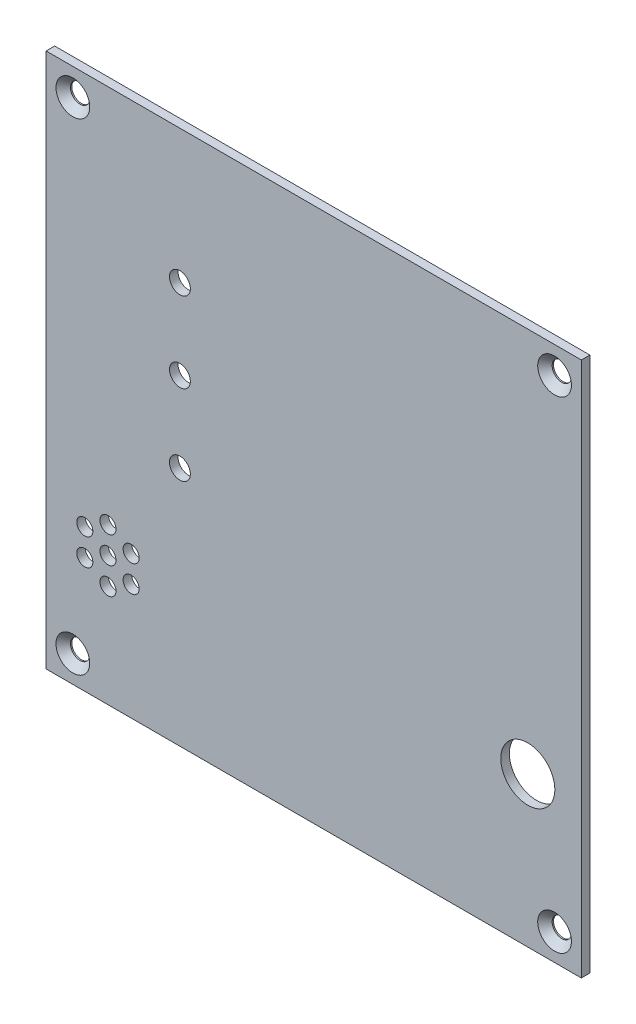
ISO-10303-21;
HEADER;
FILE_DESCRIPTION(('STEP AP214'),'2;1');
FILE_NAME('part.step','',(''),(''),'','','');
FILE_SCHEMA(('AUTOMOTIVE_DESIGN { 1 0 10303 214 1 1 1 1 }'));
ENDSEC;
DATA;
#1=APPLICATION_CONTEXT('core data for automotive mechanical design processes');
#2=APPLICATION_PROTOCOL_DEFINITION('international standard','automotive_design',2000,#1);
#3=PRODUCT_CONTEXT('',#1,'mechanical');
#4=PRODUCT('Part','Part','',(#3));
#5=PRODUCT_RELATED_PRODUCT_CATEGORY('part','',(#4));
#6=PRODUCT_DEFINITION_FORMATION('','',#4);
#7=PRODUCT_DEFINITION_CONTEXT('part definition',#1,'design');
#8=PRODUCT_DEFINITION('design','',#6,#7);
#9=PRODUCT_DEFINITION_SHAPE('','',#8);
#10=(LENGTH_UNIT() NAMED_UNIT(*) SI_UNIT(.MILLI.,.METRE.));
#11=(NAMED_UNIT(*) PLANE_ANGLE_UNIT() SI_UNIT($,.RADIAN.));
#12=(NAMED_UNIT(*) SI_UNIT($,.STERADIAN.) SOLID_ANGLE_UNIT());
#13=UNCERTAINTY_MEASURE_WITH_UNIT(LENGTH_MEASURE(1.E-05),#10,'distance_accuracy_value','');
#14=(GEOMETRIC_REPRESENTATION_CONTEXT(3) GLOBAL_UNCERTAINTY_ASSIGNED_CONTEXT((#13)) GLOBAL_UNIT_ASSIGNED_CONTEXT((#10,
#11,#12)) REPRESENTATION_CONTEXT('',''));
#15=CARTESIAN_POINT('',(0.,0.,0.));
#16=DIRECTION('',(0.,0.,1.));
#17=DIRECTION('',(1.,0.,0.));
#18=AXIS2_PLACEMENT_3D('',#15,#16,#17);
#19=CARTESIAN_POINT('',(0.,0.,0.));
#20=DIRECTION('',(0.,0.,-1.));
#21=DIRECTION('',(-1.,0.,0.));
#22=AXIS2_PLACEMENT_3D('',#19,#20,#21);
#23=PLANE('',#22);
#24=CARTESIAN_POINT('',(90.,28.,0.));
#25=DIRECTION('',(0.,0.,1.));
#26=DIRECTION('',(1.,0.,0.));
#27=AXIS2_PLACEMENT_3D('',#24,#25,#26);
#28=CIRCLE('',#27,5.05);
#29=CARTESIAN_POINT('',(95.05,28.,0.));
#30=VERTEX_POINT('',#29);
#31=EDGE_CURVE('E147',#30,#30,#28,.T.);
#32=ORIENTED_EDGE('',*,*,#31,.T.);
#33=EDGE_LOOP('',(#32));
#34=FACE_BOUND('',#33,.T.);
#35=CARTESIAN_POINT('',(25.0000000000003,45.,0.));
#36=DIRECTION('',(0.,0.,1.));
#37=DIRECTION('',(1.,0.,0.));
#38=AXIS2_PLACEMENT_3D('',#35,#36,#37);
#39=CIRCLE('',#38,1.95);
#40=CARTESIAN_POINT('',(26.9500000000003,45.,0.));
#41=VERTEX_POINT('',#40);
#42=EDGE_CURVE('E201',#41,#41,#39,.T.);
#43=ORIENTED_EDGE('',*,*,#42,.T.);
#44=EDGE_LOOP('',(#43));
#45=FACE_BOUND('',#44,.T.);
#46=CARTESIAN_POINT('',(25.0000000000001,60.,0.));
#47=DIRECTION('',(0.,0.,1.));
#48=DIRECTION('',(1.,0.,0.));
#49=AXIS2_PLACEMENT_3D('',#46,#47,#48);
#50=CIRCLE('',#49,1.95);
#51=CARTESIAN_POINT('',(26.9500000000001,60.,0.));
#52=VERTEX_POINT('',#51);
#53=EDGE_CURVE('E178',#52,#52,#50,.T.);
#54=ORIENTED_EDGE('',*,*,#53,.T.);
#55=EDGE_LOOP('',(#54));
#56=FACE_BOUND('',#55,.T.);
#57=CARTESIAN_POINT('',(15.8871270189222,26.63,0.));
#58=DIRECTION('',(0.,0.,1.));
#59=DIRECTION('',(1.,0.,0.));
#60=AXIS2_PLACEMENT_3D('',#57,#58,#59);
#61=CIRCLE('',#60,1.5);
#62=CARTESIAN_POINT('',(17.3871270189222,26.63,0.));
#63=VERTEX_POINT('',#62);
#64=EDGE_CURVE('E165',#63,#63,#61,.T.);
#65=ORIENTED_EDGE('',*,*,#64,.T.);
#66=EDGE_LOOP('',(#65));
#67=FACE_BOUND('',#66,.T.);
#68=CARTESIAN_POINT('',(11.557,29.13,0.));
#69=DIRECTION('',(0.,0.,1.));
#70=DIRECTION('',(1.,0.,0.));
#71=AXIS2_PLACEMENT_3D('',#68,#69,#70);
#72=CIRCLE('',#71,1.5);
#73=CARTESIAN_POINT('',(13.057,29.13,0.));
#74=VERTEX_POINT('',#73);
#75=EDGE_CURVE('E152',#74,#74,#72,.T.);
#76=ORIENTED_EDGE('',*,*,#75,.T.);
#77=EDGE_LOOP('',(#76));
#78=FACE_BOUND('',#77,.T.);
#79=CARTESIAN_POINT('',(25.,75.,0.));
#80=DIRECTION('',(0.,0.,1.));
#81=DIRECTION('',(1.,0.,0.));
#82=AXIS2_PLACEMENT_3D('',#79,#80,#81);
#83=CIRCLE('',#82,1.95);
#84=CARTESIAN_POINT('',(26.95,75.,0.));
#85=VERTEX_POINT('',#84);
#86=EDGE_CURVE('E151',#85,#85,#83,.T.);
#87=ORIENTED_EDGE('',*,*,#86,.T.);
#88=EDGE_LOOP('',(#87));
#89=FACE_BOUND('',#88,.T.);
#90=CARTESIAN_POINT('',(11.557,24.13,0.));
#91=DIRECTION('',(0.,0.,1.));
#92=DIRECTION('',(1.,0.,0.));
#93=AXIS2_PLACEMENT_3D('',#90,#91,#92);
#94=CIRCLE('',#93,1.5);
#95=CARTESIAN_POINT('',(13.057,24.13,0.));
#96=VERTEX_POINT('',#95);
#97=EDGE_CURVE('E158',#96,#96,#94,.T.);
#98=ORIENTED_EDGE('',*,*,#97,.T.);
#99=EDGE_LOOP('',(#98));
#100=FACE_BOUND('',#99,.T.);
#101=CARTESIAN_POINT('',(15.8871270189223,21.63,0.));
#102=DIRECTION('',(0.,0.,1.));
#103=DIRECTION('',(1.,0.,0.));
#104=AXIS2_PLACEMENT_3D('',#101,#102,#103);
#105=CIRCLE('',#104,1.5);
#106=CARTESIAN_POINT('',(17.3871270189223,21.63,0.));
#107=VERTEX_POINT('',#106);
#108=EDGE_CURVE('E166',#107,#107,#105,.T.);
#109=ORIENTED_EDGE('',*,*,#108,.T.);
#110=EDGE_LOOP('',(#109));
#111=FACE_BOUND('',#110,.T.);
#112=CARTESIAN_POINT('',(11.5570000000001,19.13,0.));
#113=DIRECTION('',(0.,0.,1.));
#114=DIRECTION('',(1.,0.,0.));
#115=AXIS2_PLACEMENT_3D('',#112,#113,#114);
#116=CIRCLE('',#115,1.5);
#117=CARTESIAN_POINT('',(13.0570000000001,19.13,0.));
#118=VERTEX_POINT('',#117);
#119=EDGE_CURVE('E190',#118,#118,#116,.T.);
#120=ORIENTED_EDGE('',*,*,#119,.T.);
#121=EDGE_LOOP('',(#120));
#122=FACE_BOUND('',#121,.T.);
#123=CARTESIAN_POINT('',(7.22687298107787,21.63,0.));
#124=DIRECTION('',(0.,0.,1.));
#125=DIRECTION('',(1.,0.,0.));
#126=AXIS2_PLACEMENT_3D('',#123,#124,#125);
#127=CIRCLE('',#126,1.5);
#128=CARTESIAN_POINT('',(8.72687298107787,21.63,0.));
#129=VERTEX_POINT('',#128);
#130=EDGE_CURVE('E184',#129,#129,#127,.T.);
#131=ORIENTED_EDGE('',*,*,#130,.T.);
#132=EDGE_LOOP('',(#131));
#133=FACE_BOUND('',#132,.T.);
#134=CARTESIAN_POINT('',(7.22687298107785,26.63,0.));
#135=DIRECTION('',(0.,0.,1.));
#136=DIRECTION('',(1.,0.,0.));
#137=AXIS2_PLACEMENT_3D('',#134,#135,#136);
#138=CIRCLE('',#137,1.5);
#139=CARTESIAN_POINT('',(8.72687298107786,26.63,0.));
#140=VERTEX_POINT('',#139);
#141=EDGE_CURVE('E177',#140,#140,#138,.T.);
#142=ORIENTED_EDGE('',*,*,#141,.T.);
#143=EDGE_LOOP('',(#142));
#144=FACE_BOUND('',#143,.T.);
#145=CARTESIAN_POINT('',(4.99999999999999,95.,0.));
#146=DIRECTION('',(0.,0.,1.));
#147=DIRECTION('',(1.,0.,0.));
#148=AXIS2_PLACEMENT_3D('',#145,#146,#147);
#149=CIRCLE('',#148,1.8);
#150=CARTESIAN_POINT('',(6.79999999999999,95.,0.));
#151=VERTEX_POINT('',#150);
#152=EDGE_CURVE('E138',#151,#151,#149,.T.);
#153=ORIENTED_EDGE('',*,*,#152,.T.);
#154=EDGE_LOOP('',(#153));
#155=FACE_BOUND('',#154,.T.);
#156=CARTESIAN_POINT('',(95.,95.,0.));
#157=DIRECTION('',(0.,0.,1.));
#158=DIRECTION('',(1.,0.,0.));
#159=AXIS2_PLACEMENT_3D('',#156,#157,#158);
#160=CIRCLE('',#159,1.8);
#161=CARTESIAN_POINT('',(96.8,95.,0.));
#162=VERTEX_POINT('',#161);
#163=EDGE_CURVE('E129',#162,#162,#160,.T.);
#164=ORIENTED_EDGE('',*,*,#163,.T.);
#165=EDGE_LOOP('',(#164));
#166=FACE_BOUND('',#165,.T.);
#167=DIRECTION('',(0.,-1.,0.));
#168=VECTOR('',#167,1.);
#169=CARTESIAN_POINT('',(0.,0.,0.));
#170=LINE('',#169,#168);
#171=CARTESIAN_POINT('',(0.,100.,0.));
#172=VERTEX_POINT('',#171);
#173=CARTESIAN_POINT('',(0.,0.,0.));
#174=VERTEX_POINT('',#173);
#175=EDGE_CURVE('E98',#172,#174,#170,.T.);
#176=ORIENTED_EDGE('',*,*,#175,.F.);
#177=DIRECTION('',(-1.,0.,0.));
#178=VECTOR('',#177,1.);
#179=CARTESIAN_POINT('',(0.,100.,0.));
#180=LINE('',#179,#178);
#181=CARTESIAN_POINT('',(100.,100.,0.));
#182=VERTEX_POINT('',#181);
#183=EDGE_CURVE('E74',#182,#172,#180,.T.);
#184=ORIENTED_EDGE('',*,*,#183,.F.);
#185=DIRECTION('',(0.,1.,0.));
#186=VECTOR('',#185,1.);
#187=CARTESIAN_POINT('',(100.,0.,0.));
#188=LINE('',#187,#186);
#189=CARTESIAN_POINT('',(100.,0.,0.));
#190=VERTEX_POINT('',#189);
#191=EDGE_CURVE('E68',#190,#182,#188,.T.);
#192=ORIENTED_EDGE('',*,*,#191,.F.);
#193=DIRECTION('',(1.,0.,0.));
#194=VECTOR('',#193,1.);
#195=CARTESIAN_POINT('',(0.,0.,0.));
#196=LINE('',#195,#194);
#197=EDGE_CURVE('E90',#174,#190,#196,.T.);
#198=ORIENTED_EDGE('',*,*,#197,.F.);
#199=EDGE_LOOP('',(#176,#184,#192,#198));
#200=FACE_BOUND('',#199,.T.);
#201=CARTESIAN_POINT('',(4.99999999999999,5.,0.));
#202=DIRECTION('',(0.,0.,1.));
#203=DIRECTION('',(1.,0.,0.));
#204=AXIS2_PLACEMENT_3D('',#201,#202,#203);
#205=CIRCLE('',#204,1.8);
#206=CARTESIAN_POINT('',(6.79999999999999,5.,0.));
#207=VERTEX_POINT('',#206);
#208=EDGE_CURVE('E101',#207,#207,#205,.T.);
#209=ORIENTED_EDGE('',*,*,#208,.T.);
#210=EDGE_LOOP('',(#209));
#211=FACE_BOUND('',#210,.T.);
#212=CARTESIAN_POINT('',(95.,5.,0.));
#213=DIRECTION('',(0.,0.,1.));
#214=DIRECTION('',(1.,0.,0.));
#215=AXIS2_PLACEMENT_3D('',#212,#213,#214);
#216=CIRCLE('',#215,1.8);
#217=CARTESIAN_POINT('',(96.8,5.,0.));
#218=VERTEX_POINT('',#217);
#219=EDGE_CURVE('E120',#218,#218,#216,.T.);
#220=ORIENTED_EDGE('',*,*,#219,.T.);
#221=EDGE_LOOP('',(#220));
#222=FACE_BOUND('',#221,.T.);
#223=ADVANCED_FACE('F34',(#34,#45,#56,#67,#78,#89,#100,#111,#122,#133,#144,#155,#166,#200,#211,
#222),#23,.T.);
#224=CARTESIAN_POINT('',(0.,0.,1.6));
#225=DIRECTION('',(1.,0.,0.));
#226=DIRECTION('',(0.,1.,0.));
#227=AXIS2_PLACEMENT_3D('',#224,#225,#226);
#228=PLANE('',#227);
#229=ORIENTED_EDGE('',*,*,#175,.T.);
#230=DIRECTION('',(0.,0.,-1.));
#231=VECTOR('',#230,1.);
#232=CARTESIAN_POINT('',(0.,0.,1.6));
#233=LINE('',#232,#231);
#234=CARTESIAN_POINT('',(0.,0.,1.6));
#235=VERTEX_POINT('',#234);
#236=EDGE_CURVE('E11',#235,#174,#233,.T.);
#237=ORIENTED_EDGE('',*,*,#236,.F.);
#238=DIRECTION('',(0.,-1.,0.));
#239=VECTOR('',#238,1.);
#240=CARTESIAN_POINT('',(0.,0.,1.6));
#241=LINE('',#240,#239);
#242=CARTESIAN_POINT('',(0.,100.,1.6));
#243=VERTEX_POINT('',#242);
#244=EDGE_CURVE('E86',#243,#235,#241,.T.);
#245=ORIENTED_EDGE('',*,*,#244,.F.);
#246=DIRECTION('',(0.,0.,-1.));
#247=VECTOR('',#246,1.);
#248=CARTESIAN_POINT('',(0.,100.,1.6));
#249=LINE('',#248,#247);
#250=EDGE_CURVE('E94',#243,#172,#249,.T.);
#251=ORIENTED_EDGE('',*,*,#250,.T.);
#252=EDGE_LOOP('',(#229,#237,#245,#251));
#253=FACE_BOUND('',#252,.T.);
#254=ADVANCED_FACE('F36',(#253),#228,.F.);
#255=CARTESIAN_POINT('',(0.,0.,1.6));
#256=DIRECTION('',(0.,1.,0.));
#257=DIRECTION('',(0.,0.,1.));
#258=AXIS2_PLACEMENT_3D('',#255,#256,#257);
#259=PLANE('',#258);
#260=ORIENTED_EDGE('',*,*,#197,.T.);
#261=DIRECTION('',(0.,0.,-1.));
#262=VECTOR('',#261,1.);
#263=CARTESIAN_POINT('',(100.,0.,1.6));
#264=LINE('',#263,#262);
#265=CARTESIAN_POINT('',(100.,0.,1.6));
#266=VERTEX_POINT('',#265);
#267=EDGE_CURVE('E43',#266,#190,#264,.T.);
#268=ORIENTED_EDGE('',*,*,#267,.F.);
#269=DIRECTION('',(1.,0.,0.));
#270=VECTOR('',#269,1.);
#271=CARTESIAN_POINT('',(0.,0.,1.6));
#272=LINE('',#271,#270);
#273=EDGE_CURVE('E81',#235,#266,#272,.T.);
#274=ORIENTED_EDGE('',*,*,#273,.F.);
#275=ORIENTED_EDGE('',*,*,#236,.T.);
#276=EDGE_LOOP('',(#260,#268,#274,#275));
#277=FACE_BOUND('',#276,.T.);
#278=ADVANCED_FACE('F89',(#277),#259,.F.);
#279=CARTESIAN_POINT('',(100.,0.,1.6));
#280=DIRECTION('',(-1.,0.,0.));
#281=DIRECTION('',(0.,-1.,0.));
#282=AXIS2_PLACEMENT_3D('',#279,#280,#281);
#283=PLANE('',#282);
#284=ORIENTED_EDGE('',*,*,#191,.T.);
#285=DIRECTION('',(0.,0.,-1.));
#286=VECTOR('',#285,1.);
#287=CARTESIAN_POINT('',(100.,100.,1.6));
#288=LINE('',#287,#286);
#289=CARTESIAN_POINT('',(100.,100.,1.6));
#290=VERTEX_POINT('',#289);
#291=EDGE_CURVE('E91',#290,#182,#288,.T.);
#292=ORIENTED_EDGE('',*,*,#291,.F.);
#293=DIRECTION('',(0.,1.,0.));
#294=VECTOR('',#293,1.);
#295=CARTESIAN_POINT('',(100.,0.,1.6));
#296=LINE('',#295,#294);
#297=EDGE_CURVE('E84',#266,#290,#296,.T.);
#298=ORIENTED_EDGE('',*,*,#297,.F.);
#299=ORIENTED_EDGE('',*,*,#267,.T.);
#300=EDGE_LOOP('',(#284,#292,#298,#299));
#301=FACE_BOUND('',#300,.T.);
#302=ADVANCED_FACE('F92',(#301),#283,.F.);
#303=CARTESIAN_POINT('',(0.,100.,1.6));
#304=DIRECTION('',(0.,-1.,0.));
#305=DIRECTION('',(0.,0.,-1.));
#306=AXIS2_PLACEMENT_3D('',#303,#304,#305);
#307=PLANE('',#306);
#308=ORIENTED_EDGE('',*,*,#183,.T.);
#309=ORIENTED_EDGE('',*,*,#250,.F.);
#310=DIRECTION('',(-1.,0.,0.));
#311=VECTOR('',#310,1.);
#312=CARTESIAN_POINT('',(0.,100.,1.6));
#313=LINE('',#312,#311);
#314=EDGE_CURVE('E51',#290,#243,#313,.T.);
#315=ORIENTED_EDGE('',*,*,#314,.F.);
#316=ORIENTED_EDGE('',*,*,#291,.T.);
#317=EDGE_LOOP('',(#308,#309,#315,#316));
#318=FACE_BOUND('',#317,.T.);
#319=ADVANCED_FACE('F106',(#318),#307,.F.);
#320=CARTESIAN_POINT('',(0.,0.,1.6));
#321=DIRECTION('',(0.,0.,-1.));
#322=DIRECTION('',(-1.,0.,0.));
#323=AXIS2_PLACEMENT_3D('',#320,#321,#322);
#324=PLANE('',#323);
#325=CARTESIAN_POINT('',(90.,28.,1.6));
#326=DIRECTION('',(0.,0.,1.));
#327=DIRECTION('',(1.,0.,0.));
#328=AXIS2_PLACEMENT_3D('',#325,#326,#327);
#329=CIRCLE('',#328,5.05);
#330=CARTESIAN_POINT('',(95.05,28.,1.6));
#331=VERTEX_POINT('',#330);
#332=EDGE_CURVE('E161',#331,#331,#329,.T.);
#333=ORIENTED_EDGE('',*,*,#332,.F.);
#334=EDGE_LOOP('',(#333));
#335=FACE_BOUND('',#334,.T.);
#336=CARTESIAN_POINT('',(25.0000000000003,45.,1.6));
#337=DIRECTION('',(0.,0.,1.));
#338=DIRECTION('',(1.,0.,0.));
#339=AXIS2_PLACEMENT_3D('',#336,#337,#338);
#340=CIRCLE('',#339,1.95);
#341=CARTESIAN_POINT('',(26.9500000000003,45.,1.6));
#342=VERTEX_POINT('',#341);
#343=EDGE_CURVE('E198',#342,#342,#340,.T.);
#344=ORIENTED_EDGE('',*,*,#343,.F.);
#345=EDGE_LOOP('',(#344));
#346=FACE_BOUND('',#345,.T.);
#347=CARTESIAN_POINT('',(25.0000000000001,60.,1.6));
#348=DIRECTION('',(0.,0.,1.));
#349=DIRECTION('',(1.,0.,0.));
#350=AXIS2_PLACEMENT_3D('',#347,#348,#349);
#351=CIRCLE('',#350,1.95);
#352=CARTESIAN_POINT('',(26.9500000000001,60.,1.6));
#353=VERTEX_POINT('',#352);
#354=EDGE_CURVE('E204',#353,#353,#351,.T.);
#355=ORIENTED_EDGE('',*,*,#354,.F.);
#356=EDGE_LOOP('',(#355));
#357=FACE_BOUND('',#356,.T.);
#358=CARTESIAN_POINT('',(15.8871270189222,26.63,1.6));
#359=DIRECTION('',(0.,0.,1.));
#360=DIRECTION('',(1.,0.,0.));
#361=AXIS2_PLACEMENT_3D('',#358,#359,#360);
#362=CIRCLE('',#361,1.5);
#363=CARTESIAN_POINT('',(17.3871270189222,26.63,1.6));
#364=VERTEX_POINT('',#363);
#365=EDGE_CURVE('E162',#364,#364,#362,.T.);
#366=ORIENTED_EDGE('',*,*,#365,.F.);
#367=EDGE_LOOP('',(#366));
#368=FACE_BOUND('',#367,.T.);
#369=CARTESIAN_POINT('',(11.557,29.13,1.6));
#370=DIRECTION('',(0.,0.,1.));
#371=DIRECTION('',(1.,0.,0.));
#372=AXIS2_PLACEMENT_3D('',#369,#370,#371);
#373=CIRCLE('',#372,1.5);
#374=CARTESIAN_POINT('',(13.057,29.13,1.6));
#375=VERTEX_POINT('',#374);
#376=EDGE_CURVE('E169',#375,#375,#373,.T.);
#377=ORIENTED_EDGE('',*,*,#376,.F.);
#378=EDGE_LOOP('',(#377));
#379=FACE_BOUND('',#378,.T.);
#380=CARTESIAN_POINT('',(25.,75.,1.6));
#381=DIRECTION('',(0.,0.,1.));
#382=DIRECTION('',(1.,0.,0.));
#383=AXIS2_PLACEMENT_3D('',#380,#381,#382);
#384=CIRCLE('',#383,1.95);
#385=CARTESIAN_POINT('',(26.95,75.,1.6));
#386=VERTEX_POINT('',#385);
#387=EDGE_CURVE('E148',#386,#386,#384,.T.);
#388=ORIENTED_EDGE('',*,*,#387,.F.);
#389=EDGE_LOOP('',(#388));
#390=FACE_BOUND('',#389,.T.);
#391=CARTESIAN_POINT('',(11.557,24.13,1.6));
#392=DIRECTION('',(0.,0.,1.));
#393=DIRECTION('',(1.,0.,0.));
#394=AXIS2_PLACEMENT_3D('',#391,#392,#393);
#395=CIRCLE('',#394,1.5);
#396=CARTESIAN_POINT('',(13.057,24.13,1.6));
#397=VERTEX_POINT('',#396);
#398=EDGE_CURVE('E155',#397,#397,#395,.T.);
#399=ORIENTED_EDGE('',*,*,#398,.F.);
#400=EDGE_LOOP('',(#399));
#401=FACE_BOUND('',#400,.T.);
#402=CARTESIAN_POINT('',(15.8871270189223,21.63,1.6));
#403=DIRECTION('',(0.,0.,1.));
#404=DIRECTION('',(1.,0.,0.));
#405=AXIS2_PLACEMENT_3D('',#402,#403,#404);
#406=CIRCLE('',#405,1.5);
#407=CARTESIAN_POINT('',(17.3871270189223,21.63,1.6));
#408=VERTEX_POINT('',#407);
#409=EDGE_CURVE('E193',#408,#408,#406,.T.);
#410=ORIENTED_EDGE('',*,*,#409,.F.);
#411=EDGE_LOOP('',(#410));
#412=FACE_BOUND('',#411,.T.);
#413=CARTESIAN_POINT('',(11.5570000000001,19.13,1.6));
#414=DIRECTION('',(0.,0.,1.));
#415=DIRECTION('',(1.,0.,0.));
#416=AXIS2_PLACEMENT_3D('',#413,#414,#415);
#417=CIRCLE('',#416,1.5);
#418=CARTESIAN_POINT('',(13.0570000000001,19.13,1.6));
#419=VERTEX_POINT('',#418);
#420=EDGE_CURVE('E187',#419,#419,#417,.T.);
#421=ORIENTED_EDGE('',*,*,#420,.F.);
#422=EDGE_LOOP('',(#421));
#423=FACE_BOUND('',#422,.T.);
#424=CARTESIAN_POINT('',(7.22687298107787,21.63,1.6));
#425=DIRECTION('',(0.,0.,1.));
#426=DIRECTION('',(1.,0.,0.));
#427=AXIS2_PLACEMENT_3D('',#424,#425,#426);
#428=CIRCLE('',#427,1.5);
#429=CARTESIAN_POINT('',(8.72687298107787,21.63,1.6));
#430=VERTEX_POINT('',#429);
#431=EDGE_CURVE('E181',#430,#430,#428,.T.);
#432=ORIENTED_EDGE('',*,*,#431,.F.);
#433=EDGE_LOOP('',(#432));
#434=FACE_BOUND('',#433,.T.);
#435=CARTESIAN_POINT('',(7.22687298107785,26.63,1.6));
#436=DIRECTION('',(0.,0.,1.));
#437=DIRECTION('',(1.,0.,0.));
#438=AXIS2_PLACEMENT_3D('',#435,#436,#437);
#439=CIRCLE('',#438,1.5);
#440=CARTESIAN_POINT('',(8.72687298107786,26.63,1.6));
#441=VERTEX_POINT('',#440);
#442=EDGE_CURVE('E174',#441,#441,#439,.T.);
#443=ORIENTED_EDGE('',*,*,#442,.F.);
#444=EDGE_LOOP('',(#443));
#445=FACE_BOUND('',#444,.T.);
#446=CARTESIAN_POINT('',(4.99999999999999,95.,1.6));
#447=DIRECTION('',(0.,0.,1.));
#448=DIRECTION('',(1.,0.,0.));
#449=AXIS2_PLACEMENT_3D('',#446,#447,#448);
#450=CIRCLE('',#449,3.15);
#451=CARTESIAN_POINT('',(8.14999999999999,95.,1.6));
#452=VERTEX_POINT('',#451);
#453=EDGE_CURVE('E144',#452,#452,#450,.T.);
#454=ORIENTED_EDGE('',*,*,#453,.F.);
#455=EDGE_LOOP('',(#454));
#456=FACE_BOUND('',#455,.T.);
#457=CARTESIAN_POINT('',(95.,95.,1.6));
#458=DIRECTION('',(0.,0.,1.));
#459=DIRECTION('',(1.,0.,0.));
#460=AXIS2_PLACEMENT_3D('',#457,#458,#459);
#461=CIRCLE('',#460,3.15);
#462=CARTESIAN_POINT('',(98.15,95.,1.6));
#463=VERTEX_POINT('',#462);
#464=EDGE_CURVE('E135',#463,#463,#461,.T.);
#465=ORIENTED_EDGE('',*,*,#464,.F.);
#466=EDGE_LOOP('',(#465));
#467=FACE_BOUND('',#466,.T.);
#468=CARTESIAN_POINT('',(95.,5.,1.6));
#469=DIRECTION('',(0.,0.,1.));
#470=DIRECTION('',(1.,0.,0.));
#471=AXIS2_PLACEMENT_3D('',#468,#469,#470);
#472=CIRCLE('',#471,3.15);
#473=CARTESIAN_POINT('',(98.15,5.,1.6));
#474=VERTEX_POINT('',#473);
#475=EDGE_CURVE('E126',#474,#474,#472,.T.);
#476=ORIENTED_EDGE('',*,*,#475,.F.);
#477=EDGE_LOOP('',(#476));
#478=FACE_BOUND('',#477,.T.);
#479=CARTESIAN_POINT('',(4.99999999999999,5.,1.6));
#480=DIRECTION('',(0.,0.,1.));
#481=DIRECTION('',(1.,0.,0.));
#482=AXIS2_PLACEMENT_3D('',#479,#480,#481);
#483=CIRCLE('',#482,3.15);
#484=CARTESIAN_POINT('',(8.14999999999999,5.,1.6));
#485=VERTEX_POINT('',#484);
#486=EDGE_CURVE('E117',#485,#485,#483,.T.);
#487=ORIENTED_EDGE('',*,*,#486,.F.);
#488=EDGE_LOOP('',(#487));
#489=FACE_BOUND('',#488,.T.);
#490=ORIENTED_EDGE('',*,*,#244,.T.);
#491=ORIENTED_EDGE('',*,*,#273,.T.);
#492=ORIENTED_EDGE('',*,*,#297,.T.);
#493=ORIENTED_EDGE('',*,*,#314,.T.);
#494=EDGE_LOOP('',(#490,#491,#492,#493));
#495=FACE_BOUND('',#494,.T.);
#496=ADVANCED_FACE('F82',(#335,#346,#357,#368,#379,#390,#401,#412,#423,#434,#445,#456,#467,#478,
#489,#495),#324,.F.);
#497=CARTESIAN_POINT('',(4.99999999999999,5.,1.6));
#498=DIRECTION('',(0.,0.,1.));
#499=DIRECTION('',(1.,0.,0.));
#500=AXIS2_PLACEMENT_3D('',#497,#498,#499);
#501=CYLINDRICAL_SURFACE('',#500,1.8);
#502=ORIENTED_EDGE('',*,*,#208,.F.);
#503=EDGE_LOOP('',(#502));
#504=FACE_BOUND('',#503,.T.);
#505=CARTESIAN_POINT('',(4.99999999999999,5.,0.25));
#506=DIRECTION('',(0.,0.,1.));
#507=DIRECTION('',(1.,0.,0.));
#508=AXIS2_PLACEMENT_3D('',#505,#506,#507);
#509=CIRCLE('',#508,1.8);
#510=CARTESIAN_POINT('',(6.79999999999999,5.,0.25));
#511=VERTEX_POINT('',#510);
#512=EDGE_CURVE('E114',#511,#511,#509,.T.);
#513=ORIENTED_EDGE('',*,*,#512,.T.);
#514=EDGE_LOOP('',(#513));
#515=FACE_BOUND('',#514,.T.);
#516=ADVANCED_FACE('F225',(#504,#515),#501,.F.);
#517=CARTESIAN_POINT('',(4.99999999999999,5.,1.6));
#518=DIRECTION('',(0.,0.,1.));
#519=DIRECTION('',(1.,0.,0.));
#520=AXIS2_PLACEMENT_3D('',#517,#518,#519);
#521=CONICAL_SURFACE('',#520,3.15,0.785398163397449);
#522=ORIENTED_EDGE('',*,*,#512,.F.);
#523=EDGE_LOOP('',(#522));
#524=FACE_BOUND('',#523,.T.);
#525=ORIENTED_EDGE('',*,*,#486,.T.);
#526=EDGE_LOOP('',(#525));
#527=FACE_BOUND('',#526,.T.);
#528=ADVANCED_FACE('F255',(#524,#527),#521,.F.);
#529=CARTESIAN_POINT('',(95.,5.,1.6));
#530=DIRECTION('',(0.,0.,1.));
#531=DIRECTION('',(1.,0.,0.));
#532=AXIS2_PLACEMENT_3D('',#529,#530,#531);
#533=CYLINDRICAL_SURFACE('',#532,1.8);
#534=ORIENTED_EDGE('',*,*,#219,.F.);
#535=EDGE_LOOP('',(#534));
#536=FACE_BOUND('',#535,.T.);
#537=CARTESIAN_POINT('',(95.,5.,0.25));
#538=DIRECTION('',(0.,0.,1.));
#539=DIRECTION('',(1.,0.,0.));
#540=AXIS2_PLACEMENT_3D('',#537,#538,#539);
#541=CIRCLE('',#540,1.8);
#542=CARTESIAN_POINT('',(96.8,5.,0.25));
#543=VERTEX_POINT('',#542);
#544=EDGE_CURVE('E123',#543,#543,#541,.T.);
#545=ORIENTED_EDGE('',*,*,#544,.T.);
#546=EDGE_LOOP('',(#545));
#547=FACE_BOUND('',#546,.T.);
#548=ADVANCED_FACE('F257',(#536,#547),#533,.F.);
#549=CARTESIAN_POINT('',(95.,5.,1.6));
#550=DIRECTION('',(0.,0.,1.));
#551=DIRECTION('',(1.,0.,0.));
#552=AXIS2_PLACEMENT_3D('',#549,#550,#551);
#553=CONICAL_SURFACE('',#552,3.15,0.78539816339745);
#554=ORIENTED_EDGE('',*,*,#544,.F.);
#555=EDGE_LOOP('',(#554));
#556=FACE_BOUND('',#555,.T.);
#557=ORIENTED_EDGE('',*,*,#475,.T.);
#558=EDGE_LOOP('',(#557));
#559=FACE_BOUND('',#558,.T.);
#560=ADVANCED_FACE('F264',(#556,#559),#553,.F.);
#561=CARTESIAN_POINT('',(95.,95.,1.6));
#562=DIRECTION('',(0.,0.,1.));
#563=DIRECTION('',(1.,0.,0.));
#564=AXIS2_PLACEMENT_3D('',#561,#562,#563);
#565=CYLINDRICAL_SURFACE('',#564,1.8);
#566=ORIENTED_EDGE('',*,*,#163,.F.);
#567=EDGE_LOOP('',(#566));
#568=FACE_BOUND('',#567,.T.);
#569=CARTESIAN_POINT('',(95.,95.,0.25));
#570=DIRECTION('',(0.,0.,1.));
#571=DIRECTION('',(1.,0.,0.));
#572=AXIS2_PLACEMENT_3D('',#569,#570,#571);
#573=CIRCLE('',#572,1.8);
#574=CARTESIAN_POINT('',(96.8,95.,0.25));
#575=VERTEX_POINT('',#574);
#576=EDGE_CURVE('E132',#575,#575,#573,.T.);
#577=ORIENTED_EDGE('',*,*,#576,.T.);
#578=EDGE_LOOP('',(#577));
#579=FACE_BOUND('',#578,.T.);
#580=ADVANCED_FACE('F321',(#568,#579),#565,.F.);
#581=CARTESIAN_POINT('',(95.,95.,1.6));
#582=DIRECTION('',(0.,0.,1.));
#583=DIRECTION('',(1.,0.,0.));
#584=AXIS2_PLACEMENT_3D('',#581,#582,#583);
#585=CONICAL_SURFACE('',#584,3.15,0.78539816339745);
#586=ORIENTED_EDGE('',*,*,#576,.F.);
#587=EDGE_LOOP('',(#586));
#588=FACE_BOUND('',#587,.T.);
#589=ORIENTED_EDGE('',*,*,#464,.T.);
#590=EDGE_LOOP('',(#589));
#591=FACE_BOUND('',#590,.T.);
#592=ADVANCED_FACE('F331',(#588,#591),#585,.F.);
#593=CARTESIAN_POINT('',(4.99999999999999,95.,1.6));
#594=DIRECTION('',(0.,0.,1.));
#595=DIRECTION('',(1.,0.,0.));
#596=AXIS2_PLACEMENT_3D('',#593,#594,#595);
#597=CYLINDRICAL_SURFACE('',#596,1.8);
#598=ORIENTED_EDGE('',*,*,#152,.F.);
#599=EDGE_LOOP('',(#598));
#600=FACE_BOUND('',#599,.T.);
#601=CARTESIAN_POINT('',(4.99999999999999,95.,0.25));
#602=DIRECTION('',(0.,0.,1.));
#603=DIRECTION('',(1.,0.,0.));
#604=AXIS2_PLACEMENT_3D('',#601,#602,#603);
#605=CIRCLE('',#604,1.8);
#606=CARTESIAN_POINT('',(6.79999999999999,95.,0.25));
#607=VERTEX_POINT('',#606);
#608=EDGE_CURVE('E141',#607,#607,#605,.T.);
#609=ORIENTED_EDGE('',*,*,#608,.T.);
#610=EDGE_LOOP('',(#609));
#611=FACE_BOUND('',#610,.T.);
#612=ADVANCED_FACE('F341',(#600,#611),#597,.F.);
#613=CARTESIAN_POINT('',(4.99999999999999,95.,1.6));
#614=DIRECTION('',(0.,0.,1.));
#615=DIRECTION('',(1.,0.,0.));
#616=AXIS2_PLACEMENT_3D('',#613,#614,#615);
#617=CONICAL_SURFACE('',#616,3.15,0.785398163397449);
#618=ORIENTED_EDGE('',*,*,#608,.F.);
#619=EDGE_LOOP('',(#618));
#620=FACE_BOUND('',#619,.T.);
#621=ORIENTED_EDGE('',*,*,#453,.T.);
#622=EDGE_LOOP('',(#621));
#623=FACE_BOUND('',#622,.T.);
#624=ADVANCED_FACE('F351',(#620,#623),#617,.F.);
#625=CARTESIAN_POINT('',(7.22687298107785,26.63,0.));
#626=DIRECTION('',(0.,0.,1.));
#627=DIRECTION('',(1.,0.,0.));
#628=AXIS2_PLACEMENT_3D('',#625,#626,#627);
#629=CYLINDRICAL_SURFACE('',#628,1.5);
#630=ORIENTED_EDGE('',*,*,#141,.F.);
#631=EDGE_LOOP('',(#630));
#632=FACE_BOUND('',#631,.T.);
#633=ORIENTED_EDGE('',*,*,#442,.T.);
#634=EDGE_LOOP('',(#633));
#635=FACE_BOUND('',#634,.T.);
#636=ADVANCED_FACE('F360',(#632,#635),#629,.F.);
#637=CARTESIAN_POINT('',(7.22687298107787,21.63,0.));
#638=DIRECTION('',(0.,0.,1.));
#639=DIRECTION('',(1.,0.,0.));
#640=AXIS2_PLACEMENT_3D('',#637,#638,#639);
#641=CYLINDRICAL_SURFACE('',#640,1.5);
#642=ORIENTED_EDGE('',*,*,#130,.F.);
#643=EDGE_LOOP('',(#642));
#644=FACE_BOUND('',#643,.T.);
#645=ORIENTED_EDGE('',*,*,#431,.T.);
#646=EDGE_LOOP('',(#645));
#647=FACE_BOUND('',#646,.T.);
#648=ADVANCED_FACE('F385',(#644,#647),#641,.F.);
#649=CARTESIAN_POINT('',(11.5570000000001,19.13,0.));
#650=DIRECTION('',(0.,0.,1.));
#651=DIRECTION('',(1.,0.,0.));
#652=AXIS2_PLACEMENT_3D('',#649,#650,#651);
#653=CYLINDRICAL_SURFACE('',#652,1.5);
#654=ORIENTED_EDGE('',*,*,#119,.F.);
#655=EDGE_LOOP('',(#654));
#656=FACE_BOUND('',#655,.T.);
#657=ORIENTED_EDGE('',*,*,#420,.T.);
#658=EDGE_LOOP('',(#657));
#659=FACE_BOUND('',#658,.T.);
#660=ADVANCED_FACE('F392',(#656,#659),#653,.F.);
#661=CARTESIAN_POINT('',(15.8871270189223,21.63,0.));
#662=DIRECTION('',(0.,0.,1.));
#663=DIRECTION('',(1.,0.,0.));
#664=AXIS2_PLACEMENT_3D('',#661,#662,#663);
#665=CYLINDRICAL_SURFACE('',#664,1.5);
#666=ORIENTED_EDGE('',*,*,#108,.F.);
#667=EDGE_LOOP('',(#666));
#668=FACE_BOUND('',#667,.T.);
#669=ORIENTED_EDGE('',*,*,#409,.T.);
#670=EDGE_LOOP('',(#669));
#671=FACE_BOUND('',#670,.T.);
#672=ADVANCED_FACE('F400',(#668,#671),#665,.F.);
#673=CARTESIAN_POINT('',(11.557,24.13,0.));
#674=DIRECTION('',(0.,0.,1.));
#675=DIRECTION('',(1.,0.,0.));
#676=AXIS2_PLACEMENT_3D('',#673,#674,#675);
#677=CYLINDRICAL_SURFACE('',#676,1.5);
#678=ORIENTED_EDGE('',*,*,#97,.F.);
#679=EDGE_LOOP('',(#678));
#680=FACE_BOUND('',#679,.T.);
#681=ORIENTED_EDGE('',*,*,#398,.T.);
#682=EDGE_LOOP('',(#681));
#683=FACE_BOUND('',#682,.T.);
#684=ADVANCED_FACE('F408',(#680,#683),#677,.F.);
#685=CARTESIAN_POINT('',(25.,75.,0.));
#686=DIRECTION('',(0.,0.,1.));
#687=DIRECTION('',(1.,0.,0.));
#688=AXIS2_PLACEMENT_3D('',#685,#686,#687);
#689=CYLINDRICAL_SURFACE('',#688,1.95);
#690=ORIENTED_EDGE('',*,*,#86,.F.);
#691=EDGE_LOOP('',(#690));
#692=FACE_BOUND('',#691,.T.);
#693=ORIENTED_EDGE('',*,*,#387,.T.);
#694=EDGE_LOOP('',(#693));
#695=FACE_BOUND('',#694,.T.);
#696=ADVANCED_FACE('F416',(#692,#695),#689,.F.);
#697=CARTESIAN_POINT('',(11.557,29.13,0.));
#698=DIRECTION('',(0.,0.,1.));
#699=DIRECTION('',(1.,0.,0.));
#700=AXIS2_PLACEMENT_3D('',#697,#698,#699);
#701=CYLINDRICAL_SURFACE('',#700,1.5);
#702=ORIENTED_EDGE('',*,*,#75,.F.);
#703=EDGE_LOOP('',(#702));
#704=FACE_BOUND('',#703,.T.);
#705=ORIENTED_EDGE('',*,*,#376,.T.);
#706=EDGE_LOOP('',(#705));
#707=FACE_BOUND('',#706,.T.);
#708=ADVANCED_FACE('F424',(#704,#707),#701,.F.);
#709=CARTESIAN_POINT('',(15.8871270189222,26.63,0.));
#710=DIRECTION('',(0.,0.,1.));
#711=DIRECTION('',(1.,0.,0.));
#712=AXIS2_PLACEMENT_3D('',#709,#710,#711);
#713=CYLINDRICAL_SURFACE('',#712,1.5);
#714=ORIENTED_EDGE('',*,*,#64,.F.);
#715=EDGE_LOOP('',(#714));
#716=FACE_BOUND('',#715,.T.);
#717=ORIENTED_EDGE('',*,*,#365,.T.);
#718=EDGE_LOOP('',(#717));
#719=FACE_BOUND('',#718,.T.);
#720=ADVANCED_FACE('F432',(#716,#719),#713,.F.);
#721=CARTESIAN_POINT('',(25.0000000000001,60.,0.));
#722=DIRECTION('',(0.,0.,1.));
#723=DIRECTION('',(1.,0.,0.));
#724=AXIS2_PLACEMENT_3D('',#721,#722,#723);
#725=CYLINDRICAL_SURFACE('',#724,1.95);
#726=ORIENTED_EDGE('',*,*,#53,.F.);
#727=EDGE_LOOP('',(#726));
#728=FACE_BOUND('',#727,.T.);
#729=ORIENTED_EDGE('',*,*,#354,.T.);
#730=EDGE_LOOP('',(#729));
#731=FACE_BOUND('',#730,.T.);
#732=ADVANCED_FACE('F440',(#728,#731),#725,.F.);
#733=CARTESIAN_POINT('',(25.0000000000003,45.,0.));
#734=DIRECTION('',(0.,0.,1.));
#735=DIRECTION('',(1.,0.,0.));
#736=AXIS2_PLACEMENT_3D('',#733,#734,#735);
#737=CYLINDRICAL_SURFACE('',#736,1.95);
#738=ORIENTED_EDGE('',*,*,#42,.F.);
#739=EDGE_LOOP('',(#738));
#740=FACE_BOUND('',#739,.T.);
#741=ORIENTED_EDGE('',*,*,#343,.T.);
#742=EDGE_LOOP('',(#741));
#743=FACE_BOUND('',#742,.T.);
#744=ADVANCED_FACE('F219',(#740,#743),#737,.F.);
#745=CARTESIAN_POINT('',(90.,28.,0.));
#746=DIRECTION('',(0.,0.,1.));
#747=DIRECTION('',(1.,0.,0.));
#748=AXIS2_PLACEMENT_3D('',#745,#746,#747);
#749=CYLINDRICAL_SURFACE('',#748,5.05);
#750=ORIENTED_EDGE('',*,*,#31,.F.);
#751=EDGE_LOOP('',(#750));
#752=FACE_BOUND('',#751,.T.);
#753=ORIENTED_EDGE('',*,*,#332,.T.);
#754=EDGE_LOOP('',(#753));
#755=FACE_BOUND('',#754,.T.);
#756=ADVANCED_FACE('F216',(#752,#755),#749,.F.);
#757=CLOSED_SHELL('',(#223,#254,#278,#302,#319,#496,#516,#528,#548,#560,#580,#592,#612,#624,
#636,#648,#660,#672,#684,#696,#708,#720,#732,#744,#756));
#758=MANIFOLD_SOLID_BREP('B2',#757);
#759=ADVANCED_BREP_SHAPE_REPRESENTATION('',(#18,#758),#14);
#760=SHAPE_DEFINITION_REPRESENTATION(#9,#759);
ENDSEC;
END-ISO-10303-21;
